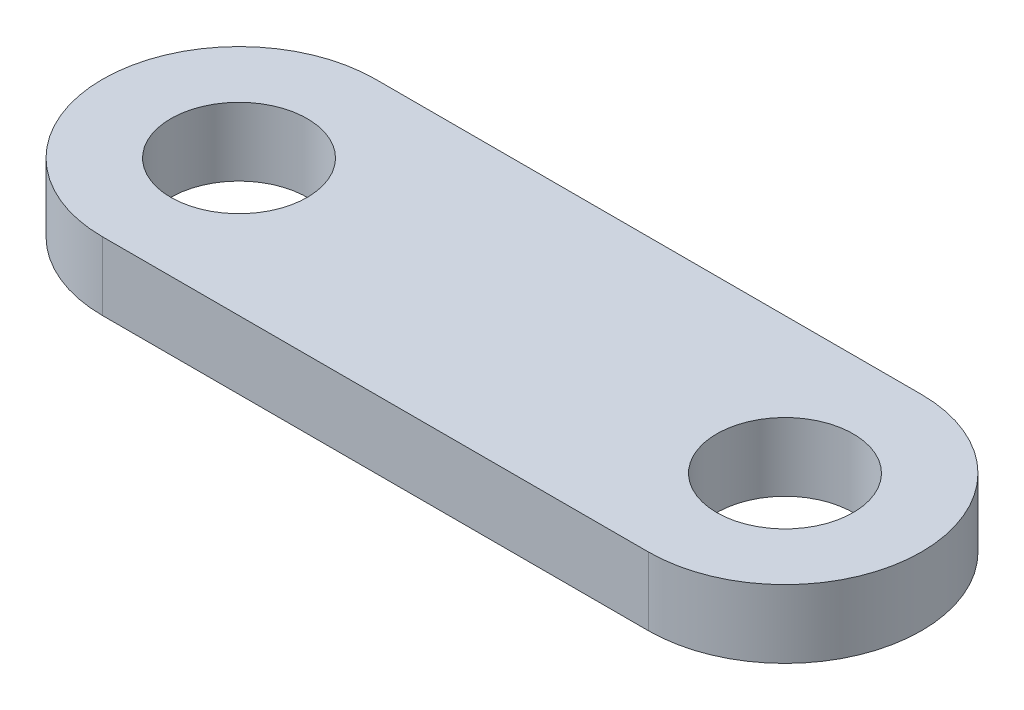
ISO-10303-21;
HEADER;
FILE_DESCRIPTION(('STEP AP214'),'2;1');
FILE_NAME('part.step','',(''),(''),'','','');
FILE_SCHEMA(('AUTOMOTIVE_DESIGN { 1 0 10303 214 1 1 1 1 }'));
ENDSEC;
DATA;
#1=APPLICATION_CONTEXT('core data for automotive mechanical design processes');
#2=APPLICATION_PROTOCOL_DEFINITION('international standard','automotive_design',2000,#1);
#3=PRODUCT_CONTEXT('',#1,'mechanical');
#4=PRODUCT('Part','Part','',(#3));
#5=PRODUCT_RELATED_PRODUCT_CATEGORY('part','',(#4));
#6=PRODUCT_DEFINITION_FORMATION('','',#4);
#7=PRODUCT_DEFINITION_CONTEXT('part definition',#1,'design');
#8=PRODUCT_DEFINITION('design','',#6,#7);
#9=PRODUCT_DEFINITION_SHAPE('','',#8);
#10=(LENGTH_UNIT() NAMED_UNIT(*) SI_UNIT(.MILLI.,.METRE.));
#11=(NAMED_UNIT(*) PLANE_ANGLE_UNIT() SI_UNIT($,.RADIAN.));
#12=(NAMED_UNIT(*) SI_UNIT($,.STERADIAN.) SOLID_ANGLE_UNIT());
#13=UNCERTAINTY_MEASURE_WITH_UNIT(LENGTH_MEASURE(1.E-05),#10,'distance_accuracy_value','');
#14=(GEOMETRIC_REPRESENTATION_CONTEXT(3) GLOBAL_UNCERTAINTY_ASSIGNED_CONTEXT((#13)) GLOBAL_UNIT_ASSIGNED_CONTEXT((#10,
#11,#12)) REPRESENTATION_CONTEXT('',''));
#15=CARTESIAN_POINT('',(0.,0.,0.));
#16=DIRECTION('',(0.,0.,1.));
#17=DIRECTION('',(1.,0.,0.));
#18=AXIS2_PLACEMENT_3D('',#15,#16,#17);
#19=CARTESIAN_POINT('',(-20.,5.,0.));
#20=DIRECTION('',(0.,1.,0.));
#21=DIRECTION('',(0.,0.,1.));
#22=AXIS2_PLACEMENT_3D('',#19,#20,#21);
#23=PLANE('',#22);
#24=CARTESIAN_POINT('',(-20.,5.,0.));
#25=DIRECTION('',(0.,1.,0.));
#26=DIRECTION('',(0.,0.,1.));
#27=AXIS2_PLACEMENT_3D('',#24,#25,#26);
#28=CIRCLE('',#27,5.);
#29=CARTESIAN_POINT('',(-20.,5.,5.));
#30=VERTEX_POINT('',#29);
#31=EDGE_CURVE('E112',#30,#30,#28,.T.);
#32=ORIENTED_EDGE('',*,*,#31,.F.);
#33=EDGE_LOOP('',(#32));
#34=FACE_BOUND('',#33,.T.);
#35=CARTESIAN_POINT('',(-20.,5.,0.));
#36=DIRECTION('',(0.,1.,0.));
#37=DIRECTION('',(0.,0.,1.));
#38=AXIS2_PLACEMENT_3D('',#35,#36,#37);
#39=CIRCLE('',#38,10.);
#40=CARTESIAN_POINT('',(-20.,5.,-10.));
#41=VERTEX_POINT('',#40);
#42=CARTESIAN_POINT('',(-20.,5.,10.));
#43=VERTEX_POINT('',#42);
#44=EDGE_CURVE('E92',#41,#43,#39,.T.);
#45=ORIENTED_EDGE('',*,*,#44,.T.);
#46=DIRECTION('',(1.,0.,0.));
#47=VECTOR('',#46,1.);
#48=CARTESIAN_POINT('',(-20.,5.,10.));
#49=LINE('',#48,#47);
#50=CARTESIAN_POINT('',(20.,5.,10.));
#51=VERTEX_POINT('',#50);
#52=EDGE_CURVE('E87',#43,#51,#49,.T.);
#53=ORIENTED_EDGE('',*,*,#52,.T.);
#54=CARTESIAN_POINT('',(20.,5.,0.));
#55=DIRECTION('',(0.,1.,0.));
#56=DIRECTION('',(0.,0.,1.));
#57=AXIS2_PLACEMENT_3D('',#54,#55,#56);
#58=CIRCLE('',#57,10.);
#59=CARTESIAN_POINT('',(20.,5.,-10.));
#60=VERTEX_POINT('',#59);
#61=EDGE_CURVE('E90',#51,#60,#58,.T.);
#62=ORIENTED_EDGE('',*,*,#61,.T.);
#63=DIRECTION('',(-1.,0.,0.));
#64=VECTOR('',#63,1.);
#65=CARTESIAN_POINT('',(-20.,5.,-10.));
#66=LINE('',#65,#64);
#67=EDGE_CURVE('E57',#60,#41,#66,.T.);
#68=ORIENTED_EDGE('',*,*,#67,.T.);
#69=EDGE_LOOP('',(#45,#53,#62,#68));
#70=FACE_BOUND('',#69,.T.);
#71=CARTESIAN_POINT('',(20.,5.,0.));
#72=DIRECTION('',(0.,1.,0.));
#73=DIRECTION('',(0.,0.,1.));
#74=AXIS2_PLACEMENT_3D('',#71,#72,#73);
#75=CIRCLE('',#74,5.);
#76=CARTESIAN_POINT('',(20.,5.,5.));
#77=VERTEX_POINT('',#76);
#78=EDGE_CURVE('E134',#77,#77,#75,.T.);
#79=ORIENTED_EDGE('',*,*,#78,.F.);
#80=EDGE_LOOP('',(#79));
#81=FACE_BOUND('',#80,.T.);
#82=ADVANCED_FACE('F39',(#34,#70,#81),#23,.T.);
#83=CARTESIAN_POINT('',(-20.,0.,0.));
#84=DIRECTION('',(0.,1.,0.));
#85=DIRECTION('',(0.,0.,1.));
#86=AXIS2_PLACEMENT_3D('',#83,#84,#85);
#87=PLANE('',#86);
#88=CARTESIAN_POINT('',(-20.,0.,0.));
#89=DIRECTION('',(0.,1.,0.));
#90=DIRECTION('',(0.,0.,1.));
#91=AXIS2_PLACEMENT_3D('',#88,#89,#90);
#92=CIRCLE('',#91,10.);
#93=CARTESIAN_POINT('',(-20.,0.,-10.));
#94=VERTEX_POINT('',#93);
#95=CARTESIAN_POINT('',(-20.,0.,10.));
#96=VERTEX_POINT('',#95);
#97=EDGE_CURVE('E108',#94,#96,#92,.T.);
#98=ORIENTED_EDGE('',*,*,#97,.F.);
#99=DIRECTION('',(-1.,0.,0.));
#100=VECTOR('',#99,1.);
#101=CARTESIAN_POINT('',(-20.,0.,-10.));
#102=LINE('',#101,#100);
#103=CARTESIAN_POINT('',(20.,0.,-10.));
#104=VERTEX_POINT('',#103);
#105=EDGE_CURVE('E80',#104,#94,#102,.T.);
#106=ORIENTED_EDGE('',*,*,#105,.F.);
#107=CARTESIAN_POINT('',(20.,0.,0.));
#108=DIRECTION('',(0.,1.,0.));
#109=DIRECTION('',(0.,0.,1.));
#110=AXIS2_PLACEMENT_3D('',#107,#108,#109);
#111=CIRCLE('',#110,10.);
#112=CARTESIAN_POINT('',(20.,0.,10.));
#113=VERTEX_POINT('',#112);
#114=EDGE_CURVE('E74',#113,#104,#111,.T.);
#115=ORIENTED_EDGE('',*,*,#114,.F.);
#116=DIRECTION('',(1.,0.,0.));
#117=VECTOR('',#116,1.);
#118=CARTESIAN_POINT('',(-20.,0.,10.));
#119=LINE('',#118,#117);
#120=EDGE_CURVE('E97',#96,#113,#119,.T.);
#121=ORIENTED_EDGE('',*,*,#120,.F.);
#122=EDGE_LOOP('',(#98,#106,#115,#121));
#123=FACE_BOUND('',#122,.T.);
#124=CARTESIAN_POINT('',(-20.,0.,0.));
#125=DIRECTION('',(0.,1.,0.));
#126=DIRECTION('',(0.,0.,1.));
#127=AXIS2_PLACEMENT_3D('',#124,#125,#126);
#128=CIRCLE('',#127,5.);
#129=CARTESIAN_POINT('',(-20.,0.,5.));
#130=VERTEX_POINT('',#129);
#131=EDGE_CURVE('E130',#130,#130,#128,.T.);
#132=ORIENTED_EDGE('',*,*,#131,.T.);
#133=EDGE_LOOP('',(#132));
#134=FACE_BOUND('',#133,.T.);
#135=CARTESIAN_POINT('',(20.,0.,0.));
#136=DIRECTION('',(0.,1.,0.));
#137=DIRECTION('',(0.,0.,1.));
#138=AXIS2_PLACEMENT_3D('',#135,#136,#137);
#139=CIRCLE('',#138,5.);
#140=CARTESIAN_POINT('',(20.,0.,5.));
#141=VERTEX_POINT('',#140);
#142=EDGE_CURVE('E138',#141,#141,#139,.T.);
#143=ORIENTED_EDGE('',*,*,#142,.T.);
#144=EDGE_LOOP('',(#143));
#145=FACE_BOUND('',#144,.T.);
#146=ADVANCED_FACE('F125',(#123,#134,#145),#87,.F.);
#147=CARTESIAN_POINT('',(-20.,5.,0.));
#148=DIRECTION('',(0.,-1.,0.));
#149=DIRECTION('',(0.,0.,-1.));
#150=AXIS2_PLACEMENT_3D('',#147,#148,#149);
#151=CYLINDRICAL_SURFACE('',#150,10.);
#152=ORIENTED_EDGE('',*,*,#97,.T.);
#153=DIRECTION('',(0.,-1.,0.));
#154=VECTOR('',#153,1.);
#155=CARTESIAN_POINT('',(-20.,5.,10.));
#156=LINE('',#155,#154);
#157=EDGE_CURVE('E11',#43,#96,#156,.T.);
#158=ORIENTED_EDGE('',*,*,#157,.F.);
#159=ORIENTED_EDGE('',*,*,#44,.F.);
#160=DIRECTION('',(0.,-1.,0.));
#161=VECTOR('',#160,1.);
#162=CARTESIAN_POINT('',(-20.,5.,-10.));
#163=LINE('',#162,#161);
#164=EDGE_CURVE('E104',#41,#94,#163,.T.);
#165=ORIENTED_EDGE('',*,*,#164,.T.);
#166=EDGE_LOOP('',(#152,#158,#159,#165));
#167=FACE_BOUND('',#166,.T.);
#168=ADVANCED_FACE('F41',(#167),#151,.T.);
#169=CARTESIAN_POINT('',(-20.,5.,10.));
#170=DIRECTION('',(0.,0.,-1.));
#171=DIRECTION('',(-1.,0.,0.));
#172=AXIS2_PLACEMENT_3D('',#169,#170,#171);
#173=PLANE('',#172);
#174=ORIENTED_EDGE('',*,*,#120,.T.);
#175=DIRECTION('',(0.,-1.,0.));
#176=VECTOR('',#175,1.);
#177=CARTESIAN_POINT('',(20.,5.,10.));
#178=LINE('',#177,#176);
#179=EDGE_CURVE('E49',#51,#113,#178,.T.);
#180=ORIENTED_EDGE('',*,*,#179,.F.);
#181=ORIENTED_EDGE('',*,*,#52,.F.);
#182=ORIENTED_EDGE('',*,*,#157,.T.);
#183=EDGE_LOOP('',(#174,#180,#181,#182));
#184=FACE_BOUND('',#183,.T.);
#185=ADVANCED_FACE('F96',(#184),#173,.F.);
#186=CARTESIAN_POINT('',(20.,5.,0.));
#187=DIRECTION('',(0.,-1.,0.));
#188=DIRECTION('',(0.,0.,-1.));
#189=AXIS2_PLACEMENT_3D('',#186,#187,#188);
#190=CYLINDRICAL_SURFACE('',#189,10.);
#191=ORIENTED_EDGE('',*,*,#114,.T.);
#192=DIRECTION('',(0.,-1.,0.));
#193=VECTOR('',#192,1.);
#194=CARTESIAN_POINT('',(20.,5.,-10.));
#195=LINE('',#194,#193);
#196=EDGE_CURVE('E99',#60,#104,#195,.T.);
#197=ORIENTED_EDGE('',*,*,#196,.F.);
#198=ORIENTED_EDGE('',*,*,#61,.F.);
#199=ORIENTED_EDGE('',*,*,#179,.T.);
#200=EDGE_LOOP('',(#191,#197,#198,#199));
#201=FACE_BOUND('',#200,.T.);
#202=ADVANCED_FACE('F100',(#201),#190,.T.);
#203=CARTESIAN_POINT('',(-20.,5.,-10.));
#204=DIRECTION('',(0.,0.,1.));
#205=DIRECTION('',(1.,0.,0.));
#206=AXIS2_PLACEMENT_3D('',#203,#204,#205);
#207=PLANE('',#206);
#208=ORIENTED_EDGE('',*,*,#105,.T.);
#209=ORIENTED_EDGE('',*,*,#164,.F.);
#210=ORIENTED_EDGE('',*,*,#67,.F.);
#211=ORIENTED_EDGE('',*,*,#196,.T.);
#212=EDGE_LOOP('',(#208,#209,#210,#211));
#213=FACE_BOUND('',#212,.T.);
#214=ADVANCED_FACE('F122',(#213),#207,.F.);
#215=CARTESIAN_POINT('',(-20.,5.,0.));
#216=DIRECTION('',(0.,-1.,0.));
#217=DIRECTION('',(0.,0.,-1.));
#218=AXIS2_PLACEMENT_3D('',#215,#216,#217);
#219=CYLINDRICAL_SURFACE('',#218,5.);
#220=ORIENTED_EDGE('',*,*,#31,.T.);
#221=EDGE_LOOP('',(#220));
#222=FACE_BOUND('',#221,.T.);
#223=ORIENTED_EDGE('',*,*,#131,.F.);
#224=EDGE_LOOP('',(#223));
#225=FACE_BOUND('',#224,.T.);
#226=ADVANCED_FACE('F157',(#222,#225),#219,.F.);
#227=CARTESIAN_POINT('',(20.,5.,0.));
#228=DIRECTION('',(0.,-1.,0.));
#229=DIRECTION('',(0.,0.,-1.));
#230=AXIS2_PLACEMENT_3D('',#227,#228,#229);
#231=CYLINDRICAL_SURFACE('',#230,5.);
#232=ORIENTED_EDGE('',*,*,#78,.T.);
#233=EDGE_LOOP('',(#232));
#234=FACE_BOUND('',#233,.T.);
#235=ORIENTED_EDGE('',*,*,#142,.F.);
#236=EDGE_LOOP('',(#235));
#237=FACE_BOUND('',#236,.T.);
#238=ADVANCED_FACE('F146',(#234,#237),#231,.F.);
#239=CLOSED_SHELL('',(#82,#146,#168,#185,#202,#214,#226,#238));
#240=MANIFOLD_SOLID_BREP('B2',#239);
#241=ADVANCED_BREP_SHAPE_REPRESENTATION('',(#18,#240),#14);
#242=SHAPE_DEFINITION_REPRESENTATION(#9,#241);
ENDSEC;
END-ISO-10303-21;
